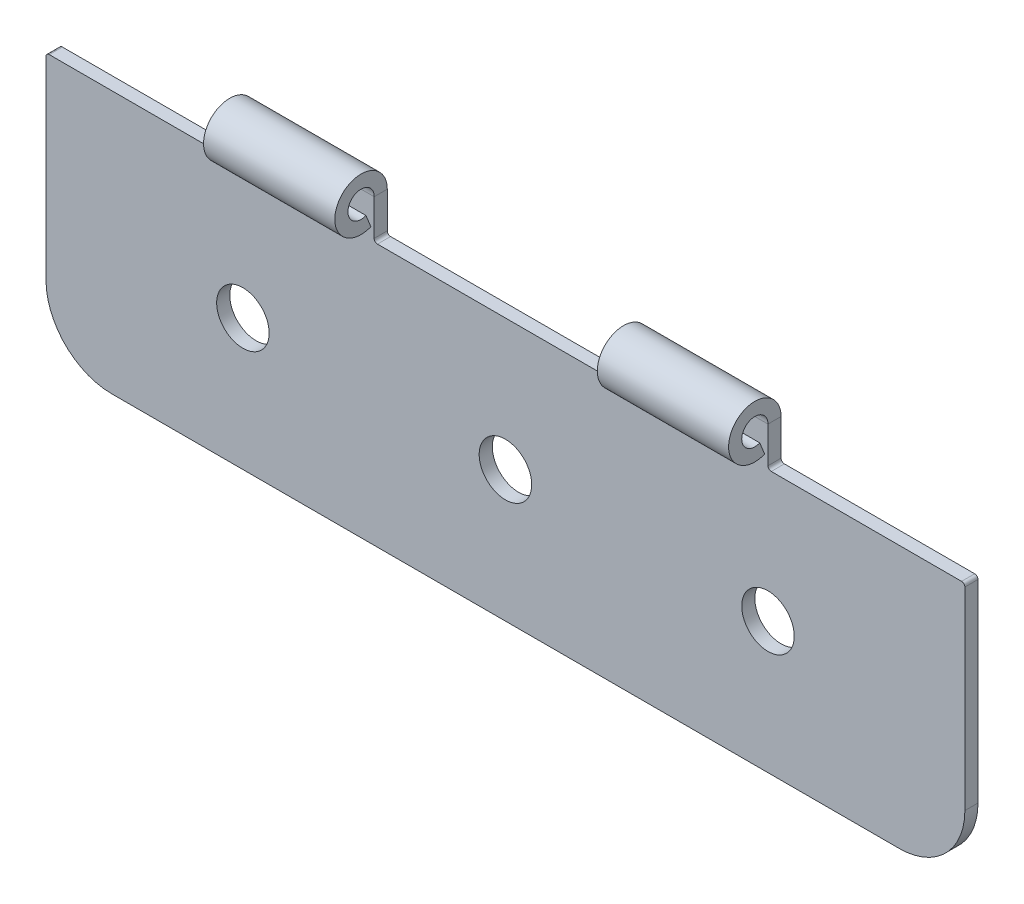
ISO-10303-21;
HEADER;
FILE_DESCRIPTION(('STEP AP214'),'2;1');
FILE_NAME('part.step','',(''),(''),'','','');
FILE_SCHEMA(('AUTOMOTIVE_DESIGN { 1 0 10303 214 1 1 1 1 }'));
ENDSEC;
DATA;
#1=APPLICATION_CONTEXT('core data for automotive mechanical design processes');
#2=APPLICATION_PROTOCOL_DEFINITION('international standard','automotive_design',2000,#1);
#3=PRODUCT_CONTEXT('',#1,'mechanical');
#4=PRODUCT('Part','Part','',(#3));
#5=PRODUCT_RELATED_PRODUCT_CATEGORY('part','',(#4));
#6=PRODUCT_DEFINITION_FORMATION('','',#4);
#7=PRODUCT_DEFINITION_CONTEXT('part definition',#1,'design');
#8=PRODUCT_DEFINITION('design','',#6,#7);
#9=PRODUCT_DEFINITION_SHAPE('','',#8);
#10=(LENGTH_UNIT() NAMED_UNIT(*) SI_UNIT(.MILLI.,.METRE.));
#11=(NAMED_UNIT(*) PLANE_ANGLE_UNIT() SI_UNIT($,.RADIAN.));
#12=(NAMED_UNIT(*) SI_UNIT($,.STERADIAN.) SOLID_ANGLE_UNIT());
#13=UNCERTAINTY_MEASURE_WITH_UNIT(LENGTH_MEASURE(1.E-05),#10,'distance_accuracy_value','');
#14=(GEOMETRIC_REPRESENTATION_CONTEXT(3) GLOBAL_UNCERTAINTY_ASSIGNED_CONTEXT((#13)) GLOBAL_UNIT_ASSIGNED_CONTEXT((#10,
#11,#12)) REPRESENTATION_CONTEXT('',''));
#15=CARTESIAN_POINT('',(0.,0.,0.));
#16=DIRECTION('',(0.,0.,1.));
#17=DIRECTION('',(1.,0.,0.));
#18=AXIS2_PLACEMENT_3D('',#15,#16,#17);
#19=CARTESIAN_POINT('',(85.,52.8350872140625,-3.69698140921907));
#20=DIRECTION('',(-1.,0.,0.));
#21=DIRECTION('',(0.,0.,1.));
#22=AXIS2_PLACEMENT_3D('',#19,#20,#21);
#23=PLANE('',#22);
#24=DIRECTION('',(0.,-1.,0.));
#25=VECTOR('',#24,1.);
#26=CARTESIAN_POINT('',(85.,52.8350872140625,-3.69698140921907));
#27=LINE('',#26,#25);
#28=CARTESIAN_POINT('',(85.,67.8350872140625,-3.69698140921908));
#29=VERTEX_POINT('',#28);
#30=CARTESIAN_POINT('',(85.,54.0850872140625,-3.69698140921907));
#31=VERTEX_POINT('',#30);
#32=EDGE_CURVE('E209',#29,#31,#27,.T.);
#33=ORIENTED_EDGE('',*,*,#32,.T.);
#34=DIRECTION('',(0.,0.,1.));
#35=VECTOR('',#34,1.);
#36=CARTESIAN_POINT('',(85.,54.0850872140625,1.30301859078093));
#37=LINE('',#36,#35);
#38=CARTESIAN_POINT('',(85.,54.0850872140625,1.30301859078093));
#39=VERTEX_POINT('',#38);
#40=EDGE_CURVE('E382',#31,#39,#37,.T.);
#41=ORIENTED_EDGE('',*,*,#40,.T.);
#42=DIRECTION('',(0.,-1.,0.));
#43=VECTOR('',#42,1.);
#44=CARTESIAN_POINT('',(85.,52.8350872140625,1.30301859078093));
#45=LINE('',#44,#43);
#46=CARTESIAN_POINT('',(85.,67.8350872140625,1.30301859078093));
#47=VERTEX_POINT('',#46);
#48=EDGE_CURVE('E325',#47,#39,#45,.T.);
#49=ORIENTED_EDGE('',*,*,#48,.F.);
#50=DIRECTION('',(0.,0.,-1.));
#51=VECTOR('',#50,1.);
#52=CARTESIAN_POINT('',(85.,67.8350872140625,1.30301859078092));
#53=LINE('',#52,#51);
#54=EDGE_CURVE('E221',#47,#29,#53,.T.);
#55=ORIENTED_EDGE('',*,*,#54,.T.);
#56=EDGE_LOOP('',(#33,#41,#49,#55));
#57=FACE_BOUND('',#56,.T.);
#58=ADVANCED_FACE('F42',(#57),#23,.T.);
#59=CARTESIAN_POINT('',(-65.,52.8350872140625,-3.69698140921907));
#60=DIRECTION('',(-1.,0.,0.));
#61=DIRECTION('',(0.,0.,1.));
#62=AXIS2_PLACEMENT_3D('',#59,#60,#61);
#63=PLANE('',#62);
#64=DIRECTION('',(0.,-1.,0.));
#65=VECTOR('',#64,1.);
#66=CARTESIAN_POINT('',(-65.,52.8350872140625,-3.69698140921907));
#67=LINE('',#66,#65);
#68=CARTESIAN_POINT('',(-65.,67.8350872140625,-3.69698140921908));
#69=VERTEX_POINT('',#68);
#70=CARTESIAN_POINT('',(-65.,54.0850872140625,-3.69698140921907));
#71=VERTEX_POINT('',#70);
#72=EDGE_CURVE('E306',#69,#71,#67,.T.);
#73=ORIENTED_EDGE('',*,*,#72,.T.);
#74=DIRECTION('',(0.,0.,1.));
#75=VECTOR('',#74,1.);
#76=CARTESIAN_POINT('',(-65.,54.0850872140625,1.30301859078093));
#77=LINE('',#76,#75);
#78=CARTESIAN_POINT('',(-65.,54.0850872140625,1.30301859078093));
#79=VERTEX_POINT('',#78);
#80=EDGE_CURVE('E385',#71,#79,#77,.T.);
#81=ORIENTED_EDGE('',*,*,#80,.T.);
#82=DIRECTION('',(0.,-1.,0.));
#83=VECTOR('',#82,1.);
#84=CARTESIAN_POINT('',(-65.,52.8350872140625,1.30301859078093));
#85=LINE('',#84,#83);
#86=CARTESIAN_POINT('',(-65.,67.8350872140625,1.30301859078093));
#87=VERTEX_POINT('',#86);
#88=EDGE_CURVE('E333',#87,#79,#85,.T.);
#89=ORIENTED_EDGE('',*,*,#88,.F.);
#90=DIRECTION('',(0.,0.,-1.));
#91=VECTOR('',#90,1.);
#92=CARTESIAN_POINT('',(-65.,67.8350872140625,1.30301859078092));
#93=LINE('',#92,#91);
#94=EDGE_CURVE('E265',#87,#69,#93,.T.);
#95=ORIENTED_EDGE('',*,*,#94,.T.);
#96=EDGE_LOOP('',(#73,#81,#89,#95));
#97=FACE_BOUND('',#96,.T.);
#98=ADVANCED_FACE('F421',(#97),#63,.T.);
#99=CARTESIAN_POINT('',(210.,-47.1649127859375,-3.69698140921907));
#100=DIRECTION('',(0.,-1.,0.));
#101=DIRECTION('',(1.,0.,0.));
#102=AXIS2_PLACEMENT_3D('',#99,#100,#101);
#103=PLANE('',#102);
#104=DIRECTION('',(1.,0.,0.));
#105=VECTOR('',#104,1.);
#106=CARTESIAN_POINT('',(210.,-47.1649127859375,-3.69698140921907));
#107=LINE('',#106,#105);
#108=CARTESIAN_POINT('',(-115.,-47.1649127859375,-3.69698140921907));
#109=VERTEX_POINT('',#108);
#110=CARTESIAN_POINT('',(185.,-47.1649127859375,-3.69698140921907));
#111=VERTEX_POINT('',#110);
#112=EDGE_CURVE('E291',#109,#111,#107,.T.);
#113=ORIENTED_EDGE('',*,*,#112,.T.);
#114=DIRECTION('',(0.,0.,1.));
#115=VECTOR('',#114,1.);
#116=CARTESIAN_POINT('',(185.,-47.1649127859375,-3.69698140921907));
#117=LINE('',#116,#115);
#118=CARTESIAN_POINT('',(185.,-47.1649127859375,1.30301859078093));
#119=VERTEX_POINT('',#118);
#120=EDGE_CURVE('E341',#111,#119,#117,.T.);
#121=ORIENTED_EDGE('',*,*,#120,.T.);
#122=DIRECTION('',(1.,0.,0.));
#123=VECTOR('',#122,1.);
#124=CARTESIAN_POINT('',(210.,-47.1649127859375,1.30301859078093));
#125=LINE('',#124,#123);
#126=CARTESIAN_POINT('',(-115.,-47.1649127859375,1.30301859078093));
#127=VERTEX_POINT('',#126);
#128=EDGE_CURVE('E288',#127,#119,#125,.T.);
#129=ORIENTED_EDGE('',*,*,#128,.F.);
#130=DIRECTION('',(0.,0.,1.));
#131=VECTOR('',#130,1.);
#132=CARTESIAN_POINT('',(-115.,-47.1649127859375,-3.69698140921907));
#133=LINE('',#132,#131);
#134=EDGE_CURVE('E314',#127,#109,#133,.F.);
#135=ORIENTED_EDGE('',*,*,#134,.T.);
#136=EDGE_LOOP('',(#113,#121,#129,#135));
#137=FACE_BOUND('',#136,.T.);
#138=ADVANCED_FACE('F478',(#137),#103,.T.);
#139=CARTESIAN_POINT('',(-140.,-47.1649127859375,-3.69698140921907));
#140=DIRECTION('',(-1.,0.,0.));
#141=DIRECTION('',(0.,0.,1.));
#142=AXIS2_PLACEMENT_3D('',#139,#140,#141);
#143=PLANE('',#142);
#144=DIRECTION('',(0.,-1.,0.));
#145=VECTOR('',#144,1.);
#146=CARTESIAN_POINT('',(-140.,-47.1649127859375,1.30301859078093));
#147=LINE('',#146,#145);
#148=CARTESIAN_POINT('',(-140.,51.5850872140625,1.30301859078093));
#149=VERTEX_POINT('',#148);
#150=CARTESIAN_POINT('',(-140.,-22.1649127859375,1.30301859078093));
#151=VERTEX_POINT('',#150);
#152=EDGE_CURVE('E295',#149,#151,#147,.T.);
#153=ORIENTED_EDGE('',*,*,#152,.F.);
#154=DIRECTION('',(0.,0.,1.));
#155=VECTOR('',#154,1.);
#156=CARTESIAN_POINT('',(-140.,51.5850872140625,-3.69698140921907));
#157=LINE('',#156,#155);
#158=CARTESIAN_POINT('',(-140.,51.5850872140625,-3.69698140921907));
#159=VERTEX_POINT('',#158);
#160=EDGE_CURVE('E393',#149,#159,#157,.F.);
#161=ORIENTED_EDGE('',*,*,#160,.T.);
#162=DIRECTION('',(0.,-1.,0.));
#163=VECTOR('',#162,1.);
#164=CARTESIAN_POINT('',(-140.,-47.1649127859375,-3.69698140921907));
#165=LINE('',#164,#163);
#166=CARTESIAN_POINT('',(-140.,-22.1649127859375,-3.69698140921907));
#167=VERTEX_POINT('',#166);
#168=EDGE_CURVE('E312',#159,#167,#165,.T.);
#169=ORIENTED_EDGE('',*,*,#168,.T.);
#170=DIRECTION('',(0.,0.,1.));
#171=VECTOR('',#170,1.);
#172=CARTESIAN_POINT('',(-140.,-22.1649127859375,-3.69698140921907));
#173=LINE('',#172,#171);
#174=EDGE_CURVE('E355',#167,#151,#173,.T.);
#175=ORIENTED_EDGE('',*,*,#174,.T.);
#176=EDGE_LOOP('',(#153,#161,#169,#175));
#177=FACE_BOUND('',#176,.T.);
#178=ADVANCED_FACE('F495',(#177),#143,.T.);
#179=CARTESIAN_POINT('',(-140.,52.8350872140625,-3.69698140921907));
#180=DIRECTION('',(0.,1.,0.));
#181=DIRECTION('',(0.,0.,1.));
#182=AXIS2_PLACEMENT_3D('',#179,#180,#181);
#183=PLANE('',#182);
#184=DIRECTION('',(-1.,0.,0.));
#185=VECTOR('',#184,1.);
#186=CARTESIAN_POINT('',(-140.,52.8350872140625,1.30301859078093));
#187=LINE('',#186,#185);
#188=CARTESIAN_POINT('',(-66.25,52.8350872140625,1.30301859078093));
#189=VERTEX_POINT('',#188);
#190=CARTESIAN_POINT('',(-138.75,52.8350872140625,1.30301859078093));
#191=VERTEX_POINT('',#190);
#192=EDGE_CURVE('E336',#189,#191,#187,.T.);
#193=ORIENTED_EDGE('',*,*,#192,.F.);
#194=DIRECTION('',(0.,0.,1.));
#195=VECTOR('',#194,1.);
#196=CARTESIAN_POINT('',(-66.25,52.8350872140625,-3.69698140921907));
#197=LINE('',#196,#195);
#198=CARTESIAN_POINT('',(-66.25,52.8350872140625,-3.69698140921907));
#199=VERTEX_POINT('',#198);
#200=EDGE_CURVE('E391',#189,#199,#197,.F.);
#201=ORIENTED_EDGE('',*,*,#200,.T.);
#202=DIRECTION('',(-1.,0.,0.));
#203=VECTOR('',#202,1.);
#204=CARTESIAN_POINT('',(-140.,52.8350872140625,-3.69698140921907));
#205=LINE('',#204,#203);
#206=CARTESIAN_POINT('',(-138.75,52.8350872140625,-3.69698140921907));
#207=VERTEX_POINT('',#206);
#208=EDGE_CURVE('E309',#199,#207,#205,.T.);
#209=ORIENTED_EDGE('',*,*,#208,.T.);
#210=DIRECTION('',(0.,0.,1.));
#211=VECTOR('',#210,1.);
#212=CARTESIAN_POINT('',(-138.75,52.8350872140625,-3.69698140921907));
#213=LINE('',#212,#211);
#214=EDGE_CURVE('E388',#207,#191,#213,.T.);
#215=ORIENTED_EDGE('',*,*,#214,.T.);
#216=EDGE_LOOP('',(#193,#201,#209,#215));
#217=FACE_BOUND('',#216,.T.);
#218=ADVANCED_FACE('F414',(#217),#183,.T.);
#219=CARTESIAN_POINT('',(-15.,77.8350872140625,-3.69698140921907));
#220=DIRECTION('',(1.,0.,0.));
#221=DIRECTION('',(0.,1.,0.));
#222=AXIS2_PLACEMENT_3D('',#219,#220,#221);
#223=PLANE('',#222);
#224=DIRECTION('',(0.,1.,0.));
#225=VECTOR('',#224,1.);
#226=CARTESIAN_POINT('',(-15.,77.8350872140625,1.30301859078093));
#227=LINE('',#226,#225);
#228=CARTESIAN_POINT('',(-15.,54.0850872140625,1.30301859078093));
#229=VERTEX_POINT('',#228);
#230=CARTESIAN_POINT('',(-15.,67.8350872140625,1.30301859078092));
#231=VERTEX_POINT('',#230);
#232=EDGE_CURVE('E331',#229,#231,#227,.T.);
#233=ORIENTED_EDGE('',*,*,#232,.F.);
#234=DIRECTION('',(0.,0.,1.));
#235=VECTOR('',#234,1.);
#236=CARTESIAN_POINT('',(-15.,54.0850872140625,-3.69698140921907));
#237=LINE('',#236,#235);
#238=CARTESIAN_POINT('',(-15.,54.0850872140625,-3.69698140921907));
#239=VERTEX_POINT('',#238);
#240=EDGE_CURVE('E380',#229,#239,#237,.F.);
#241=ORIENTED_EDGE('',*,*,#240,.T.);
#242=DIRECTION('',(0.,1.,0.));
#243=VECTOR('',#242,1.);
#244=CARTESIAN_POINT('',(-15.,77.8350872140625,-3.69698140921907));
#245=LINE('',#244,#243);
#246=CARTESIAN_POINT('',(-15.,67.8350872140625,-3.69698140921908));
#247=VERTEX_POINT('',#246);
#248=EDGE_CURVE('E304',#239,#247,#245,.T.);
#249=ORIENTED_EDGE('',*,*,#248,.T.);
#250=DIRECTION('',(0.,0.,-1.));
#251=VECTOR('',#250,1.);
#252=CARTESIAN_POINT('',(-15.,67.8350872140625,1.30301859078092));
#253=LINE('',#252,#251);
#254=EDGE_CURVE('E281',#231,#247,#253,.T.);
#255=ORIENTED_EDGE('',*,*,#254,.F.);
#256=EDGE_LOOP('',(#233,#241,#249,#255));
#257=FACE_BOUND('',#256,.T.);
#258=ADVANCED_FACE('F437',(#257),#223,.T.);
#259=CARTESIAN_POINT('',(-15.,52.8350872140625,-3.69698140921907));
#260=DIRECTION('',(0.,1.,0.));
#261=DIRECTION('',(0.,0.,1.));
#262=AXIS2_PLACEMENT_3D('',#259,#260,#261);
#263=PLANE('',#262);
#264=DIRECTION('',(-1.,0.,0.));
#265=VECTOR('',#264,1.);
#266=CARTESIAN_POINT('',(-15.,52.8350872140625,-3.69698140921907));
#267=LINE('',#266,#265);
#268=CARTESIAN_POINT('',(83.75,52.8350872140625,-3.69698140921907));
#269=VERTEX_POINT('',#268);
#270=CARTESIAN_POINT('',(-13.75,52.8350872140625,-3.69698140921907));
#271=VERTEX_POINT('',#270);
#272=EDGE_CURVE('E301',#269,#271,#267,.T.);
#273=ORIENTED_EDGE('',*,*,#272,.T.);
#274=DIRECTION('',(0.,0.,1.));
#275=VECTOR('',#274,1.);
#276=CARTESIAN_POINT('',(-13.75,52.8350872140625,1.30301859078093));
#277=LINE('',#276,#275);
#278=CARTESIAN_POINT('',(-13.75,52.8350872140625,1.30301859078093));
#279=VERTEX_POINT('',#278);
#280=EDGE_CURVE('E377',#271,#279,#277,.T.);
#281=ORIENTED_EDGE('',*,*,#280,.T.);
#282=DIRECTION('',(-1.,0.,0.));
#283=VECTOR('',#282,1.);
#284=CARTESIAN_POINT('',(-15.,52.8350872140625,1.30301859078093));
#285=LINE('',#284,#283);
#286=CARTESIAN_POINT('',(83.75,52.8350872140625,1.30301859078093));
#287=VERTEX_POINT('',#286);
#288=EDGE_CURVE('E328',#287,#279,#285,.T.);
#289=ORIENTED_EDGE('',*,*,#288,.F.);
#290=DIRECTION('',(0.,0.,1.));
#291=VECTOR('',#290,1.);
#292=CARTESIAN_POINT('',(83.75,52.8350872140625,-3.69698140921907));
#293=LINE('',#292,#291);
#294=EDGE_CURVE('E375',#287,#269,#293,.F.);
#295=ORIENTED_EDGE('',*,*,#294,.T.);
#296=EDGE_LOOP('',(#273,#281,#289,#295));
#297=FACE_BOUND('',#296,.T.);
#298=ADVANCED_FACE('F446',(#297),#263,.T.);
#299=CARTESIAN_POINT('',(135.,77.8350872140625,-3.69698140921907));
#300=DIRECTION('',(1.,0.,0.));
#301=DIRECTION('',(0.,0.,-1.));
#302=AXIS2_PLACEMENT_3D('',#299,#300,#301);
#303=PLANE('',#302);
#304=DIRECTION('',(0.,1.,0.));
#305=VECTOR('',#304,1.);
#306=CARTESIAN_POINT('',(135.,77.8350872140625,1.30301859078093));
#307=LINE('',#306,#305);
#308=CARTESIAN_POINT('',(135.,54.0850872140625,1.30301859078093));
#309=VERTEX_POINT('',#308);
#310=CARTESIAN_POINT('',(135.,67.8350872140625,1.30301859078092));
#311=VERTEX_POINT('',#310);
#312=EDGE_CURVE('E323',#309,#311,#307,.T.);
#313=ORIENTED_EDGE('',*,*,#312,.F.);
#314=DIRECTION('',(0.,0.,1.));
#315=VECTOR('',#314,1.);
#316=CARTESIAN_POINT('',(135.,54.0850872140625,-3.69698140921907));
#317=LINE('',#316,#315);
#318=CARTESIAN_POINT('',(135.,54.0850872140625,-3.69698140921907));
#319=VERTEX_POINT('',#318);
#320=EDGE_CURVE('E57',#309,#319,#317,.F.);
#321=ORIENTED_EDGE('',*,*,#320,.T.);
#322=DIRECTION('',(0.,1.,0.));
#323=VECTOR('',#322,1.);
#324=CARTESIAN_POINT('',(135.,77.8350872140625,-3.69698140921907));
#325=LINE('',#324,#323);
#326=CARTESIAN_POINT('',(135.,67.8350872140625,-3.69698140921908));
#327=VERTEX_POINT('',#326);
#328=EDGE_CURVE('E203',#319,#327,#325,.T.);
#329=ORIENTED_EDGE('',*,*,#328,.T.);
#330=DIRECTION('',(0.,0.,-1.));
#331=VECTOR('',#330,1.);
#332=CARTESIAN_POINT('',(135.,67.8350872140625,1.30301859078092));
#333=LINE('',#332,#331);
#334=EDGE_CURVE('E206',#311,#327,#333,.T.);
#335=ORIENTED_EDGE('',*,*,#334,.F.);
#336=EDGE_LOOP('',(#313,#321,#329,#335));
#337=FACE_BOUND('',#336,.T.);
#338=ADVANCED_FACE('F205',(#337),#303,.T.);
#339=CARTESIAN_POINT('',(135.,52.8350872140625,-3.69698140921907));
#340=DIRECTION('',(0.,1.,0.));
#341=DIRECTION('',(0.,0.,1.));
#342=AXIS2_PLACEMENT_3D('',#339,#340,#341);
#343=PLANE('',#342);
#344=DIRECTION('',(-1.,0.,0.));
#345=VECTOR('',#344,1.);
#346=CARTESIAN_POINT('',(135.,52.8350872140625,1.30301859078093));
#347=LINE('',#346,#345);
#348=CARTESIAN_POINT('',(208.75,52.8350872140625,1.30301859078093));
#349=VERTEX_POINT('',#348);
#350=CARTESIAN_POINT('',(136.25,52.8350872140625,1.30301859078093));
#351=VERTEX_POINT('',#350);
#352=EDGE_CURVE('E320',#349,#351,#347,.T.);
#353=ORIENTED_EDGE('',*,*,#352,.F.);
#354=DIRECTION('',(0.,0.,1.));
#355=VECTOR('',#354,1.);
#356=CARTESIAN_POINT('',(208.75,52.8350872140625,-3.69698140921907));
#357=LINE('',#356,#355);
#358=CARTESIAN_POINT('',(208.75,52.8350872140625,-3.69698140921907));
#359=VERTEX_POINT('',#358);
#360=EDGE_CURVE('E368',#349,#359,#357,.F.);
#361=ORIENTED_EDGE('',*,*,#360,.T.);
#362=DIRECTION('',(-1.,0.,0.));
#363=VECTOR('',#362,1.);
#364=CARTESIAN_POINT('',(135.,52.8350872140625,-3.69698140921907));
#365=LINE('',#364,#363);
#366=CARTESIAN_POINT('',(136.25,52.8350872140625,-3.69698140921907));
#367=VERTEX_POINT('',#366);
#368=EDGE_CURVE('E210',#359,#367,#365,.T.);
#369=ORIENTED_EDGE('',*,*,#368,.T.);
#370=DIRECTION('',(0.,0.,1.));
#371=VECTOR('',#370,1.);
#372=CARTESIAN_POINT('',(136.25,52.8350872140625,1.30301859078093));
#373=LINE('',#372,#371);
#374=EDGE_CURVE('E365',#367,#351,#373,.T.);
#375=ORIENTED_EDGE('',*,*,#374,.T.);
#376=EDGE_LOOP('',(#353,#361,#369,#375));
#377=FACE_BOUND('',#376,.T.);
#378=ADVANCED_FACE('F485',(#377),#343,.T.);
#379=CARTESIAN_POINT('',(210.,52.8350872140625,-3.69698140921907));
#380=DIRECTION('',(1.,0.,0.));
#381=DIRECTION('',(0.,0.,-1.));
#382=AXIS2_PLACEMENT_3D('',#379,#380,#381);
#383=PLANE('',#382);
#384=DIRECTION('',(0.,1.,0.));
#385=VECTOR('',#384,1.);
#386=CARTESIAN_POINT('',(210.,52.8350872140625,-3.69698140921907));
#387=LINE('',#386,#385);
#388=CARTESIAN_POINT('',(210.,-22.1649127859375,-3.69698140921907));
#389=VERTEX_POINT('',#388);
#390=CARTESIAN_POINT('',(210.,51.5850872140625,-3.69698140921907));
#391=VERTEX_POINT('',#390);
#392=EDGE_CURVE('E294',#389,#391,#387,.T.);
#393=ORIENTED_EDGE('',*,*,#392,.T.);
#394=DIRECTION('',(0.,0.,1.));
#395=VECTOR('',#394,1.);
#396=CARTESIAN_POINT('',(210.,51.5850872140625,-3.69698140921907));
#397=LINE('',#396,#395);
#398=CARTESIAN_POINT('',(210.,51.5850872140625,1.30301859078093));
#399=VERTEX_POINT('',#398);
#400=EDGE_CURVE('E358',#391,#399,#397,.T.);
#401=ORIENTED_EDGE('',*,*,#400,.T.);
#402=DIRECTION('',(0.,1.,0.));
#403=VECTOR('',#402,1.);
#404=CARTESIAN_POINT('',(210.,52.8350872140625,1.30301859078093));
#405=LINE('',#404,#403);
#406=CARTESIAN_POINT('',(210.,-22.1649127859375,1.30301859078093));
#407=VERTEX_POINT('',#406);
#408=EDGE_CURVE('E317',#407,#399,#405,.T.);
#409=ORIENTED_EDGE('',*,*,#408,.F.);
#410=DIRECTION('',(0.,0.,1.));
#411=VECTOR('',#410,1.);
#412=CARTESIAN_POINT('',(210.,-22.1649127859375,-3.69698140921907));
#413=LINE('',#412,#411);
#414=EDGE_CURVE('E348',#407,#389,#413,.F.);
#415=ORIENTED_EDGE('',*,*,#414,.T.);
#416=EDGE_LOOP('',(#393,#401,#409,#415));
#417=FACE_BOUND('',#416,.T.);
#418=ADVANCED_FACE('F488',(#417),#383,.T.);
#419=CARTESIAN_POINT('',(-140.,-47.1649127859375,-3.69698140921907));
#420=DIRECTION('',(0.,0.,-1.));
#421=DIRECTION('',(-1.,0.,0.));
#422=AXIS2_PLACEMENT_3D('',#419,#420,#421);
#423=PLANE('',#422);
#424=CARTESIAN_POINT('',(135.,2.83508721406253,-3.69698140921908));
#425=DIRECTION('',(0.,0.,1.));
#426=DIRECTION('',(1.,0.,0.));
#427=AXIS2_PLACEMENT_3D('',#424,#425,#426);
#428=CIRCLE('',#427,10.);
#429=CARTESIAN_POINT('',(145.,2.83508721406253,-3.69698140921908));
#430=VERTEX_POINT('',#429);
#431=EDGE_CURVE('E903',#430,#430,#428,.T.);
#432=ORIENTED_EDGE('',*,*,#431,.T.);
#433=EDGE_LOOP('',(#432));
#434=FACE_BOUND('',#433,.T.);
#435=CARTESIAN_POINT('',(35.,2.83508721406252,-3.69698140921908));
#436=DIRECTION('',(0.,0.,1.));
#437=DIRECTION('',(1.,0.,0.));
#438=AXIS2_PLACEMENT_3D('',#435,#436,#437);
#439=CIRCLE('',#438,10.);
#440=CARTESIAN_POINT('',(45.,2.83508721406252,-3.69698140921908));
#441=VERTEX_POINT('',#440);
#442=EDGE_CURVE('E911',#441,#441,#439,.T.);
#443=ORIENTED_EDGE('',*,*,#442,.T.);
#444=EDGE_LOOP('',(#443));
#445=FACE_BOUND('',#444,.T.);
#446=CARTESIAN_POINT('',(-65.,2.83508721406252,-3.69698140921908));
#447=DIRECTION('',(0.,0.,1.));
#448=DIRECTION('',(1.,0.,0.));
#449=AXIS2_PLACEMENT_3D('',#446,#447,#448);
#450=CIRCLE('',#449,10.);
#451=CARTESIAN_POINT('',(-55.,2.83508721406252,-3.69698140921908));
#452=VERTEX_POINT('',#451);
#453=EDGE_CURVE('E250',#452,#452,#450,.T.);
#454=ORIENTED_EDGE('',*,*,#453,.T.);
#455=EDGE_LOOP('',(#454));
#456=FACE_BOUND('',#455,.T.);
#457=ORIENTED_EDGE('',*,*,#368,.F.);
#458=CARTESIAN_POINT('',(208.75,51.5850872140625,-3.69698140921907));
#459=DIRECTION('',(0.,0.,-1.));
#460=DIRECTION('',(-1.,0.,0.));
#461=AXIS2_PLACEMENT_3D('',#458,#459,#460);
#462=CIRCLE('',#461,1.25);
#463=EDGE_CURVE('E372',#359,#391,#462,.T.);
#464=ORIENTED_EDGE('',*,*,#463,.T.);
#465=ORIENTED_EDGE('',*,*,#392,.F.);
#466=CARTESIAN_POINT('',(185.,-22.1649127859375,-3.69698140921907));
#467=DIRECTION('',(0.,0.,-1.));
#468=DIRECTION('',(-1.,0.,0.));
#469=AXIS2_PLACEMENT_3D('',#466,#467,#468);
#470=CIRCLE('',#469,25.);
#471=EDGE_CURVE('E353',#389,#111,#470,.T.);
#472=ORIENTED_EDGE('',*,*,#471,.T.);
#473=ORIENTED_EDGE('',*,*,#112,.F.);
#474=CARTESIAN_POINT('',(-115.,-22.1649127859375,-3.69698140921907));
#475=DIRECTION('',(0.,0.,-1.));
#476=DIRECTION('',(-1.,0.,0.));
#477=AXIS2_PLACEMENT_3D('',#474,#475,#476);
#478=CIRCLE('',#477,25.);
#479=EDGE_CURVE('E350',#109,#167,#478,.T.);
#480=ORIENTED_EDGE('',*,*,#479,.T.);
#481=ORIENTED_EDGE('',*,*,#168,.F.);
#482=CARTESIAN_POINT('',(-138.75,51.5850872140625,-3.69698140921907));
#483=DIRECTION('',(0.,0.,-1.));
#484=DIRECTION('',(-1.,0.,0.));
#485=AXIS2_PLACEMENT_3D('',#482,#483,#484);
#486=CIRCLE('',#485,1.25);
#487=EDGE_CURVE('E370',#159,#207,#486,.T.);
#488=ORIENTED_EDGE('',*,*,#487,.T.);
#489=ORIENTED_EDGE('',*,*,#208,.F.);
#490=CARTESIAN_POINT('',(-66.25,54.0850872140625,-3.69698140921907));
#491=DIRECTION('',(0.,0.,-1.));
#492=DIRECTION('',(-1.,0.,0.));
#493=AXIS2_PLACEMENT_3D('',#490,#491,#492);
#494=CIRCLE('',#493,1.25);
#495=EDGE_CURVE('E11',#199,#71,#494,.F.);
#496=ORIENTED_EDGE('',*,*,#495,.T.);
#497=ORIENTED_EDGE('',*,*,#72,.F.);
#498=DIRECTION('',(-1.,0.,0.));
#499=VECTOR('',#498,1.);
#500=CARTESIAN_POINT('',(-65.,67.8350872140625,-3.69698140921908));
#501=LINE('',#500,#499);
#502=EDGE_CURVE('E258',#69,#247,#501,.F.);
#503=ORIENTED_EDGE('',*,*,#502,.T.);
#504=ORIENTED_EDGE('',*,*,#248,.F.);
#505=CARTESIAN_POINT('',(-13.75,54.0850872140625,-3.69698140921907));
#506=DIRECTION('',(0.,0.,-1.));
#507=DIRECTION('',(-1.,0.,0.));
#508=AXIS2_PLACEMENT_3D('',#505,#506,#507);
#509=CIRCLE('',#508,1.25);
#510=EDGE_CURVE('E401',#239,#271,#509,.F.);
#511=ORIENTED_EDGE('',*,*,#510,.T.);
#512=ORIENTED_EDGE('',*,*,#272,.F.);
#513=CARTESIAN_POINT('',(83.75,54.0850872140625,-3.69698140921907));
#514=DIRECTION('',(0.,0.,-1.));
#515=DIRECTION('',(-1.,0.,0.));
#516=AXIS2_PLACEMENT_3D('',#513,#514,#515);
#517=CIRCLE('',#516,1.25);
#518=EDGE_CURVE('E65',#269,#31,#517,.F.);
#519=ORIENTED_EDGE('',*,*,#518,.T.);
#520=ORIENTED_EDGE('',*,*,#32,.F.);
#521=DIRECTION('',(-1.,0.,0.));
#522=VECTOR('',#521,1.);
#523=CARTESIAN_POINT('',(85.,67.8350872140625,-3.69698140921908));
#524=LINE('',#523,#522);
#525=EDGE_CURVE('E227',#29,#327,#524,.F.);
#526=ORIENTED_EDGE('',*,*,#525,.T.);
#527=ORIENTED_EDGE('',*,*,#328,.F.);
#528=CARTESIAN_POINT('',(136.25,54.0850872140625,-3.69698140921907));
#529=DIRECTION('',(0.,0.,-1.));
#530=DIRECTION('',(-1.,0.,0.));
#531=AXIS2_PLACEMENT_3D('',#528,#529,#530);
#532=CIRCLE('',#531,1.25);
#533=EDGE_CURVE('E397',#319,#367,#532,.F.);
#534=ORIENTED_EDGE('',*,*,#533,.T.);
#535=EDGE_LOOP('',(#457,#464,#465,#472,#473,#480,#481,#488,#489,#496,#497,#503,#504,#511,#512,
#519,#520,#526,#527,#534));
#536=FACE_BOUND('',#535,.T.);
#537=ADVANCED_FACE('F233',(#434,#445,#456,#536),#423,.T.);
#538=CARTESIAN_POINT('',(-140.,-47.1649127859375,1.30301859078093));
#539=DIRECTION('',(0.,0.,-1.));
#540=DIRECTION('',(-1.,0.,0.));
#541=AXIS2_PLACEMENT_3D('',#538,#539,#540);
#542=PLANE('',#541);
#543=CARTESIAN_POINT('',(135.,2.83508721406253,1.30301859078093));
#544=DIRECTION('',(0.,0.,1.));
#545=DIRECTION('',(1.,0.,0.));
#546=AXIS2_PLACEMENT_3D('',#543,#544,#545);
#547=CIRCLE('',#546,10.);
#548=CARTESIAN_POINT('',(145.,2.83508721406253,1.30301859078093));
#549=VERTEX_POINT('',#548);
#550=EDGE_CURVE('E906',#549,#549,#547,.T.);
#551=ORIENTED_EDGE('',*,*,#550,.F.);
#552=EDGE_LOOP('',(#551));
#553=FACE_BOUND('',#552,.T.);
#554=CARTESIAN_POINT('',(35.,2.83508721406252,1.30301859078093));
#555=DIRECTION('',(0.,0.,1.));
#556=DIRECTION('',(1.,0.,0.));
#557=AXIS2_PLACEMENT_3D('',#554,#555,#556);
#558=CIRCLE('',#557,10.);
#559=CARTESIAN_POINT('',(45.,2.83508721406252,1.30301859078093));
#560=VERTEX_POINT('',#559);
#561=EDGE_CURVE('E908',#560,#560,#558,.T.);
#562=ORIENTED_EDGE('',*,*,#561,.F.);
#563=EDGE_LOOP('',(#562));
#564=FACE_BOUND('',#563,.T.);
#565=CARTESIAN_POINT('',(-65.,2.83508721406252,1.30301859078093));
#566=DIRECTION('',(0.,0.,1.));
#567=DIRECTION('',(1.,0.,0.));
#568=AXIS2_PLACEMENT_3D('',#565,#566,#567);
#569=CIRCLE('',#568,10.);
#570=CARTESIAN_POINT('',(-55.,2.83508721406252,1.30301859078093));
#571=VERTEX_POINT('',#570);
#572=EDGE_CURVE('E238',#571,#571,#569,.T.);
#573=ORIENTED_EDGE('',*,*,#572,.F.);
#574=EDGE_LOOP('',(#573));
#575=FACE_BOUND('',#574,.T.);
#576=ORIENTED_EDGE('',*,*,#408,.T.);
#577=CARTESIAN_POINT('',(208.75,51.5850872140625,1.30301859078093));
#578=DIRECTION('',(0.,0.,-1.));
#579=DIRECTION('',(-1.,0.,0.));
#580=AXIS2_PLACEMENT_3D('',#577,#578,#579);
#581=CIRCLE('',#580,1.25);
#582=EDGE_CURVE('E363',#399,#349,#581,.F.);
#583=ORIENTED_EDGE('',*,*,#582,.T.);
#584=ORIENTED_EDGE('',*,*,#352,.T.);
#585=CARTESIAN_POINT('',(136.25,54.0850872140625,1.30301859078093));
#586=DIRECTION('',(0.,0.,-1.));
#587=DIRECTION('',(-1.,0.,0.));
#588=AXIS2_PLACEMENT_3D('',#585,#586,#587);
#589=CIRCLE('',#588,1.25);
#590=EDGE_CURVE('E395',#351,#309,#589,.T.);
#591=ORIENTED_EDGE('',*,*,#590,.T.);
#592=ORIENTED_EDGE('',*,*,#312,.T.);
#593=DIRECTION('',(-1.,0.,0.));
#594=VECTOR('',#593,1.);
#595=CARTESIAN_POINT('',(85.,67.8350872140625,1.30301859078092));
#596=LINE('',#595,#594);
#597=EDGE_CURVE('E243',#47,#311,#596,.F.);
#598=ORIENTED_EDGE('',*,*,#597,.F.);
#599=ORIENTED_EDGE('',*,*,#48,.T.);
#600=CARTESIAN_POINT('',(83.75,54.0850872140625,1.30301859078093));
#601=DIRECTION('',(0.,0.,-1.));
#602=DIRECTION('',(-1.,0.,0.));
#603=AXIS2_PLACEMENT_3D('',#600,#601,#602);
#604=CIRCLE('',#603,1.25);
#605=EDGE_CURVE('E403',#39,#287,#604,.T.);
#606=ORIENTED_EDGE('',*,*,#605,.T.);
#607=ORIENTED_EDGE('',*,*,#288,.T.);
#608=CARTESIAN_POINT('',(-13.75,54.0850872140625,1.30301859078093));
#609=DIRECTION('',(0.,0.,-1.));
#610=DIRECTION('',(-1.,0.,0.));
#611=AXIS2_PLACEMENT_3D('',#608,#609,#610);
#612=CIRCLE('',#611,1.25);
#613=EDGE_CURVE('E399',#279,#229,#612,.T.);
#614=ORIENTED_EDGE('',*,*,#613,.T.);
#615=ORIENTED_EDGE('',*,*,#232,.T.);
#616=DIRECTION('',(-1.,0.,0.));
#617=VECTOR('',#616,1.);
#618=CARTESIAN_POINT('',(-65.,67.8350872140625,1.30301859078092));
#619=LINE('',#618,#617);
#620=EDGE_CURVE('E274',#87,#231,#619,.F.);
#621=ORIENTED_EDGE('',*,*,#620,.F.);
#622=ORIENTED_EDGE('',*,*,#88,.T.);
#623=CARTESIAN_POINT('',(-66.25,54.0850872140625,1.30301859078093));
#624=DIRECTION('',(0.,0.,-1.));
#625=DIRECTION('',(-1.,0.,0.));
#626=AXIS2_PLACEMENT_3D('',#623,#624,#625);
#627=CIRCLE('',#626,1.25);
#628=EDGE_CURVE('E50',#79,#189,#627,.T.);
#629=ORIENTED_EDGE('',*,*,#628,.T.);
#630=ORIENTED_EDGE('',*,*,#192,.T.);
#631=CARTESIAN_POINT('',(-138.75,51.5850872140625,1.30301859078093));
#632=DIRECTION('',(0.,0.,-1.));
#633=DIRECTION('',(-1.,0.,0.));
#634=AXIS2_PLACEMENT_3D('',#631,#632,#633);
#635=CIRCLE('',#634,1.25);
#636=EDGE_CURVE('E361',#191,#149,#635,.F.);
#637=ORIENTED_EDGE('',*,*,#636,.T.);
#638=ORIENTED_EDGE('',*,*,#152,.T.);
#639=CARTESIAN_POINT('',(-115.,-22.1649127859375,1.30301859078093));
#640=DIRECTION('',(0.,0.,-1.));
#641=DIRECTION('',(-1.,0.,0.));
#642=AXIS2_PLACEMENT_3D('',#639,#640,#641);
#643=CIRCLE('',#642,25.);
#644=EDGE_CURVE('E344',#151,#127,#643,.F.);
#645=ORIENTED_EDGE('',*,*,#644,.T.);
#646=ORIENTED_EDGE('',*,*,#128,.T.);
#647=CARTESIAN_POINT('',(185.,-22.1649127859375,1.30301859078093));
#648=DIRECTION('',(0.,0.,-1.));
#649=DIRECTION('',(-1.,0.,0.));
#650=AXIS2_PLACEMENT_3D('',#647,#648,#649);
#651=CIRCLE('',#650,25.);
#652=EDGE_CURVE('E346',#119,#407,#651,.F.);
#653=ORIENTED_EDGE('',*,*,#652,.T.);
#654=EDGE_LOOP('',(#576,#583,#584,#591,#592,#598,#599,#606,#607,#614,#615,#621,#622,#629,#630,
#637,#638,#645,#646,#653));
#655=FACE_BOUND('',#654,.T.);
#656=ADVANCED_FACE('F407',(#553,#564,#575,#655),#542,.F.);
#657=CARTESIAN_POINT('',(-40.,63.1991679412286,4.42998562370133));
#658=DIRECTION('',(0.,-0.374606593415919,0.927183854566785));
#659=DIRECTION('',(-1.,0.,0.));
#660=AXIS2_PLACEMENT_3D('',#657,#658,#659);
#661=PLANE('',#660);
#662=DIRECTION('',(0.,-0.927183854566785,-0.374606593415919));
#663=VECTOR('',#662,1.);
#664=CARTESIAN_POINT('',(-65.,63.1991679412286,4.42998562370133));
#665=LINE('',#664,#663);
#666=CARTESIAN_POINT('',(-65.,63.1991679412286,4.42998562370133));
#667=VERTEX_POINT('',#666);
#668=CARTESIAN_POINT('',(-65.,58.5632486683947,2.55695265662173));
#669=VERTEX_POINT('',#668);
#670=EDGE_CURVE('E286',#667,#669,#665,.T.);
#671=ORIENTED_EDGE('',*,*,#670,.F.);
#672=DIRECTION('',(-1.,0.,0.));
#673=VECTOR('',#672,1.);
#674=CARTESIAN_POINT('',(-65.,63.1991679412286,4.42998562370133));
#675=LINE('',#674,#673);
#676=CARTESIAN_POINT('',(-15.,63.1991679412286,4.42998562370133));
#677=VERTEX_POINT('',#676);
#678=EDGE_CURVE('E255',#677,#667,#675,.T.);
#679=ORIENTED_EDGE('',*,*,#678,.F.);
#680=DIRECTION('',(0.,-0.927183854566785,-0.374606593415919));
#681=VECTOR('',#680,1.);
#682=CARTESIAN_POINT('',(-15.,63.1991679412286,4.42998562370133));
#683=LINE('',#682,#681);
#684=CARTESIAN_POINT('',(-15.,58.5632486683947,2.55695265662173));
#685=VERTEX_POINT('',#684);
#686=EDGE_CURVE('E284',#677,#685,#683,.T.);
#687=ORIENTED_EDGE('',*,*,#686,.T.);
#688=DIRECTION('',(-1.,0.,0.));
#689=VECTOR('',#688,1.);
#690=CARTESIAN_POINT('',(-65.,58.5632486683947,2.55695265662173));
#691=LINE('',#690,#689);
#692=EDGE_CURVE('E266',#685,#669,#691,.T.);
#693=ORIENTED_EDGE('',*,*,#692,.T.);
#694=EDGE_LOOP('',(#671,#679,#687,#693));
#695=FACE_BOUND('',#694,.T.);
#696=ADVANCED_FACE('F583',(#695),#661,.F.);
#697=CARTESIAN_POINT('',(-15.,67.8350872140625,6.30301859078093));
#698=DIRECTION('',(1.,0.,0.));
#699=DIRECTION('',(0.,0.,-1.));
#700=AXIS2_PLACEMENT_3D('',#697,#698,#699);
#701=PLANE('',#700);
#702=ORIENTED_EDGE('',*,*,#686,.F.);
#703=CARTESIAN_POINT('',(-15.,67.8350872140625,6.30301859078093));
#704=DIRECTION('',(-1.,0.,0.));
#705=DIRECTION('',(0.,0.,1.));
#706=AXIS2_PLACEMENT_3D('',#703,#704,#705);
#707=CIRCLE('',#706,5.00000000000001);
#708=EDGE_CURVE('E269',#231,#677,#707,.F.);
#709=ORIENTED_EDGE('',*,*,#708,.F.);
#710=ORIENTED_EDGE('',*,*,#254,.T.);
#711=CARTESIAN_POINT('',(-15.,67.8350872140625,6.30301859078093));
#712=DIRECTION('',(-1.,0.,0.));
#713=DIRECTION('',(0.,0.,1.));
#714=AXIS2_PLACEMENT_3D('',#711,#712,#713);
#715=CIRCLE('',#714,10.);
#716=EDGE_CURVE('E261',#247,#685,#715,.F.);
#717=ORIENTED_EDGE('',*,*,#716,.T.);
#718=EDGE_LOOP('',(#702,#709,#710,#717));
#719=FACE_BOUND('',#718,.T.);
#720=ADVANCED_FACE('F433',(#719),#701,.T.);
#721=CARTESIAN_POINT('',(-65.,67.8350872140625,6.30301859078093));
#722=DIRECTION('',(1.,0.,0.));
#723=DIRECTION('',(0.,0.,-1.));
#724=AXIS2_PLACEMENT_3D('',#721,#722,#723);
#725=PLANE('',#724);
#726=CARTESIAN_POINT('',(-65.,67.8350872140625,6.30301859078093));
#727=DIRECTION('',(-1.,0.,0.));
#728=DIRECTION('',(0.,0.,1.));
#729=AXIS2_PLACEMENT_3D('',#726,#727,#728);
#730=CIRCLE('',#729,5.00000000000001);
#731=EDGE_CURVE('E277',#667,#87,#730,.T.);
#732=ORIENTED_EDGE('',*,*,#731,.F.);
#733=ORIENTED_EDGE('',*,*,#670,.T.);
#734=CARTESIAN_POINT('',(-65.,67.8350872140625,6.30301859078093));
#735=DIRECTION('',(-1.,0.,0.));
#736=DIRECTION('',(0.,0.,1.));
#737=AXIS2_PLACEMENT_3D('',#734,#735,#736);
#738=CIRCLE('',#737,10.);
#739=EDGE_CURVE('E262',#669,#69,#738,.T.);
#740=ORIENTED_EDGE('',*,*,#739,.T.);
#741=ORIENTED_EDGE('',*,*,#94,.F.);
#742=EDGE_LOOP('',(#732,#733,#740,#741));
#743=FACE_BOUND('',#742,.T.);
#744=ADVANCED_FACE('F425',(#743),#725,.F.);
#745=CARTESIAN_POINT('',(-65.,67.8350872140625,6.30301859078093));
#746=DIRECTION('',(-1.,0.,0.));
#747=DIRECTION('',(0.,-0.927183854566784,-0.374606593415919));
#748=AXIS2_PLACEMENT_3D('',#745,#746,#747);
#749=CYLINDRICAL_SURFACE('',#748,10.);
#750=ORIENTED_EDGE('',*,*,#502,.F.);
#751=ORIENTED_EDGE('',*,*,#739,.F.);
#752=ORIENTED_EDGE('',*,*,#692,.F.);
#753=ORIENTED_EDGE('',*,*,#716,.F.);
#754=EDGE_LOOP('',(#750,#751,#752,#753));
#755=FACE_BOUND('',#754,.T.);
#756=ADVANCED_FACE('F470',(#755),#749,.T.);
#757=CARTESIAN_POINT('',(-65.,67.8350872140625,6.30301859078093));
#758=DIRECTION('',(-1.,0.,0.));
#759=DIRECTION('',(0.,-0.927183854566784,-0.374606593415919));
#760=AXIS2_PLACEMENT_3D('',#757,#758,#759);
#761=CYLINDRICAL_SURFACE('',#760,5.00000000000001);
#762=ORIENTED_EDGE('',*,*,#620,.T.);
#763=ORIENTED_EDGE('',*,*,#708,.T.);
#764=ORIENTED_EDGE('',*,*,#678,.T.);
#765=ORIENTED_EDGE('',*,*,#731,.T.);
#766=EDGE_LOOP('',(#762,#763,#764,#765));
#767=FACE_BOUND('',#766,.T.);
#768=ADVANCED_FACE('F430',(#767),#761,.F.);
#769=CARTESIAN_POINT('',(110.,63.1991679412286,4.42998562370133));
#770=DIRECTION('',(0.,-0.374606593415919,0.927183854566785));
#771=DIRECTION('',(-1.,0.,0.));
#772=AXIS2_PLACEMENT_3D('',#769,#770,#771);
#773=PLANE('',#772);
#774=DIRECTION('',(0.,-0.927183854566785,-0.374606593415919));
#775=VECTOR('',#774,1.);
#776=CARTESIAN_POINT('',(85.,63.1991679412286,4.42998562370133));
#777=LINE('',#776,#775);
#778=CARTESIAN_POINT('',(85.,63.1991679412286,4.42998562370133));
#779=VERTEX_POINT('',#778);
#780=CARTESIAN_POINT('',(85.,58.5632486683947,2.55695265662173));
#781=VERTEX_POINT('',#780);
#782=EDGE_CURVE('E253',#779,#781,#777,.T.);
#783=ORIENTED_EDGE('',*,*,#782,.F.);
#784=DIRECTION('',(-1.,0.,0.));
#785=VECTOR('',#784,1.);
#786=CARTESIAN_POINT('',(85.,63.1991679412286,4.42998562370133));
#787=LINE('',#786,#785);
#788=CARTESIAN_POINT('',(135.,63.1991679412286,4.42998562370133));
#789=VERTEX_POINT('',#788);
#790=EDGE_CURVE('E248',#789,#779,#787,.T.);
#791=ORIENTED_EDGE('',*,*,#790,.F.);
#792=DIRECTION('',(0.,-0.927183854566785,-0.374606593415919));
#793=VECTOR('',#792,1.);
#794=CARTESIAN_POINT('',(135.,63.1991679412286,4.42998562370133));
#795=LINE('',#794,#793);
#796=CARTESIAN_POINT('',(135.,58.5632486683947,2.55695265662173));
#797=VERTEX_POINT('',#796);
#798=EDGE_CURVE('E220',#789,#797,#795,.T.);
#799=ORIENTED_EDGE('',*,*,#798,.T.);
#800=DIRECTION('',(-1.,0.,0.));
#801=VECTOR('',#800,1.);
#802=CARTESIAN_POINT('',(85.,58.5632486683947,2.55695265662173));
#803=LINE('',#802,#801);
#804=EDGE_CURVE('E230',#797,#781,#803,.T.);
#805=ORIENTED_EDGE('',*,*,#804,.T.);
#806=EDGE_LOOP('',(#783,#791,#799,#805));
#807=FACE_BOUND('',#806,.T.);
#808=ADVANCED_FACE('F462',(#807),#773,.F.);
#809=CARTESIAN_POINT('',(135.,67.8350872140625,6.30301859078093));
#810=DIRECTION('',(1.,0.,0.));
#811=DIRECTION('',(0.,0.,-1.));
#812=AXIS2_PLACEMENT_3D('',#809,#810,#811);
#813=PLANE('',#812);
#814=ORIENTED_EDGE('',*,*,#798,.F.);
#815=CARTESIAN_POINT('',(135.,67.8350872140625,6.30301859078093));
#816=DIRECTION('',(-1.,0.,0.));
#817=DIRECTION('',(0.,0.,1.));
#818=AXIS2_PLACEMENT_3D('',#815,#816,#817);
#819=CIRCLE('',#818,5.00000000000001);
#820=EDGE_CURVE('E219',#311,#789,#819,.F.);
#821=ORIENTED_EDGE('',*,*,#820,.F.);
#822=ORIENTED_EDGE('',*,*,#334,.T.);
#823=CARTESIAN_POINT('',(135.,67.8350872140625,6.30301859078093));
#824=DIRECTION('',(-1.,0.,0.));
#825=DIRECTION('',(0.,0.,1.));
#826=AXIS2_PLACEMENT_3D('',#823,#824,#825);
#827=CIRCLE('',#826,10.);
#828=EDGE_CURVE('E217',#327,#797,#827,.F.);
#829=ORIENTED_EDGE('',*,*,#828,.T.);
#830=EDGE_LOOP('',(#814,#821,#822,#829));
#831=FACE_BOUND('',#830,.T.);
#832=ADVANCED_FACE('F216',(#831),#813,.T.);
#833=CARTESIAN_POINT('',(85.,67.8350872140625,6.30301859078093));
#834=DIRECTION('',(1.,0.,0.));
#835=DIRECTION('',(0.,0.,-1.));
#836=AXIS2_PLACEMENT_3D('',#833,#834,#835);
#837=PLANE('',#836);
#838=CARTESIAN_POINT('',(85.,67.8350872140625,6.30301859078093));
#839=DIRECTION('',(-1.,0.,0.));
#840=DIRECTION('',(0.,0.,1.));
#841=AXIS2_PLACEMENT_3D('',#838,#839,#840);
#842=CIRCLE('',#841,5.00000000000001);
#843=EDGE_CURVE('E246',#779,#47,#842,.T.);
#844=ORIENTED_EDGE('',*,*,#843,.F.);
#845=ORIENTED_EDGE('',*,*,#782,.T.);
#846=CARTESIAN_POINT('',(85.,67.8350872140625,6.30301859078093));
#847=DIRECTION('',(-1.,0.,0.));
#848=DIRECTION('',(0.,0.,1.));
#849=AXIS2_PLACEMENT_3D('',#846,#847,#848);
#850=CIRCLE('',#849,10.);
#851=EDGE_CURVE('E234',#781,#29,#850,.T.);
#852=ORIENTED_EDGE('',*,*,#851,.T.);
#853=ORIENTED_EDGE('',*,*,#54,.F.);
#854=EDGE_LOOP('',(#844,#845,#852,#853));
#855=FACE_BOUND('',#854,.T.);
#856=ADVANCED_FACE('F457',(#855),#837,.F.);
#857=CARTESIAN_POINT('',(85.,67.8350872140625,6.30301859078093));
#858=DIRECTION('',(-1.,0.,0.));
#859=DIRECTION('',(0.,-0.927183854566784,-0.374606593415919));
#860=AXIS2_PLACEMENT_3D('',#857,#858,#859);
#861=CYLINDRICAL_SURFACE('',#860,10.);
#862=ORIENTED_EDGE('',*,*,#525,.F.);
#863=ORIENTED_EDGE('',*,*,#851,.F.);
#864=ORIENTED_EDGE('',*,*,#804,.F.);
#865=ORIENTED_EDGE('',*,*,#828,.F.);
#866=EDGE_LOOP('',(#862,#863,#864,#865));
#867=FACE_BOUND('',#866,.T.);
#868=ADVANCED_FACE('F225',(#867),#861,.T.);
#869=CARTESIAN_POINT('',(85.,67.8350872140625,6.30301859078093));
#870=DIRECTION('',(-1.,0.,0.));
#871=DIRECTION('',(0.,-0.927183854566784,-0.374606593415919));
#872=AXIS2_PLACEMENT_3D('',#869,#870,#871);
#873=CYLINDRICAL_SURFACE('',#872,5.00000000000001);
#874=ORIENTED_EDGE('',*,*,#597,.T.);
#875=ORIENTED_EDGE('',*,*,#820,.T.);
#876=ORIENTED_EDGE('',*,*,#790,.T.);
#877=ORIENTED_EDGE('',*,*,#843,.T.);
#878=EDGE_LOOP('',(#874,#875,#876,#877));
#879=FACE_BOUND('',#878,.T.);
#880=ADVANCED_FACE('F459',(#879),#873,.F.);
#881=CARTESIAN_POINT('',(-65.,2.83508721406252,-3.69698140921908));
#882=DIRECTION('',(0.,0.,1.));
#883=DIRECTION('',(1.,0.,0.));
#884=AXIS2_PLACEMENT_3D('',#881,#882,#883);
#885=CYLINDRICAL_SURFACE('',#884,10.);
#886=ORIENTED_EDGE('',*,*,#453,.F.);
#887=EDGE_LOOP('',(#886));
#888=FACE_BOUND('',#887,.T.);
#889=ORIENTED_EDGE('',*,*,#572,.T.);
#890=EDGE_LOOP('',(#889));
#891=FACE_BOUND('',#890,.T.);
#892=ADVANCED_FACE('F653',(#888,#891),#885,.F.);
#893=CARTESIAN_POINT('',(35.,2.83508721406252,-3.69698140921908));
#894=DIRECTION('',(0.,0.,1.));
#895=DIRECTION('',(1.,0.,0.));
#896=AXIS2_PLACEMENT_3D('',#893,#894,#895);
#897=CYLINDRICAL_SURFACE('',#896,10.);
#898=ORIENTED_EDGE('',*,*,#442,.F.);
#899=EDGE_LOOP('',(#898));
#900=FACE_BOUND('',#899,.T.);
#901=ORIENTED_EDGE('',*,*,#561,.T.);
#902=EDGE_LOOP('',(#901));
#903=FACE_BOUND('',#902,.T.);
#904=ADVANCED_FACE('F663',(#900,#903),#897,.F.);
#905=CARTESIAN_POINT('',(135.,2.83508721406253,-3.69698140921908));
#906=DIRECTION('',(0.,0.,1.));
#907=DIRECTION('',(1.,0.,0.));
#908=AXIS2_PLACEMENT_3D('',#905,#906,#907);
#909=CYLINDRICAL_SURFACE('',#908,10.);
#910=ORIENTED_EDGE('',*,*,#431,.F.);
#911=EDGE_LOOP('',(#910));
#912=FACE_BOUND('',#911,.T.);
#913=ORIENTED_EDGE('',*,*,#550,.T.);
#914=EDGE_LOOP('',(#913));
#915=FACE_BOUND('',#914,.T.);
#916=ADVANCED_FACE('F501',(#912,#915),#909,.F.);
#917=CARTESIAN_POINT('',(185.,-22.1649127859375,-3.69698140921907));
#918=DIRECTION('',(0.,0.,1.));
#919=DIRECTION('',(1.,0.,0.));
#920=AXIS2_PLACEMENT_3D('',#917,#918,#919);
#921=CYLINDRICAL_SURFACE('',#920,25.);
#922=ORIENTED_EDGE('',*,*,#471,.F.);
#923=ORIENTED_EDGE('',*,*,#414,.F.);
#924=ORIENTED_EDGE('',*,*,#652,.F.);
#925=ORIENTED_EDGE('',*,*,#120,.F.);
#926=EDGE_LOOP('',(#922,#923,#924,#925));
#927=FACE_BOUND('',#926,.T.);
#928=ADVANCED_FACE('F497',(#927),#921,.T.);
#929=CARTESIAN_POINT('',(-115.,-22.1649127859375,-3.69698140921907));
#930=DIRECTION('',(0.,0.,1.));
#931=DIRECTION('',(1.,0.,0.));
#932=AXIS2_PLACEMENT_3D('',#929,#930,#931);
#933=CYLINDRICAL_SURFACE('',#932,25.);
#934=ORIENTED_EDGE('',*,*,#479,.F.);
#935=ORIENTED_EDGE('',*,*,#134,.F.);
#936=ORIENTED_EDGE('',*,*,#644,.F.);
#937=ORIENTED_EDGE('',*,*,#174,.F.);
#938=EDGE_LOOP('',(#934,#935,#936,#937));
#939=FACE_BOUND('',#938,.T.);
#940=ADVANCED_FACE('F500',(#939),#933,.T.);
#941=CARTESIAN_POINT('',(208.75,51.5850872140625,-3.69698140921907));
#942=DIRECTION('',(0.,0.,1.));
#943=DIRECTION('',(1.,0.,0.));
#944=AXIS2_PLACEMENT_3D('',#941,#942,#943);
#945=CYLINDRICAL_SURFACE('',#944,1.25);
#946=ORIENTED_EDGE('',*,*,#463,.F.);
#947=ORIENTED_EDGE('',*,*,#360,.F.);
#948=ORIENTED_EDGE('',*,*,#582,.F.);
#949=ORIENTED_EDGE('',*,*,#400,.F.);
#950=EDGE_LOOP('',(#946,#947,#948,#949));
#951=FACE_BOUND('',#950,.T.);
#952=ADVANCED_FACE('F505',(#951),#945,.T.);
#953=CARTESIAN_POINT('',(136.25,54.0850872140625,-3.69698140921907));
#954=DIRECTION('',(0.,0.,-1.));
#955=DIRECTION('',(-1.,0.,0.));
#956=AXIS2_PLACEMENT_3D('',#953,#954,#955);
#957=CYLINDRICAL_SURFACE('',#956,1.25);
#958=ORIENTED_EDGE('',*,*,#533,.F.);
#959=ORIENTED_EDGE('',*,*,#320,.F.);
#960=ORIENTED_EDGE('',*,*,#590,.F.);
#961=ORIENTED_EDGE('',*,*,#374,.F.);
#962=EDGE_LOOP('',(#958,#959,#960,#961));
#963=FACE_BOUND('',#962,.T.);
#964=ADVANCED_FACE('F509',(#963),#957,.F.);
#965=CARTESIAN_POINT('',(-13.75,54.0850872140625,-3.69698140921907));
#966=DIRECTION('',(0.,0.,-1.));
#967=DIRECTION('',(-1.,0.,0.));
#968=AXIS2_PLACEMENT_3D('',#965,#966,#967);
#969=CYLINDRICAL_SURFACE('',#968,1.25);
#970=ORIENTED_EDGE('',*,*,#510,.F.);
#971=ORIENTED_EDGE('',*,*,#240,.F.);
#972=ORIENTED_EDGE('',*,*,#613,.F.);
#973=ORIENTED_EDGE('',*,*,#280,.F.);
#974=EDGE_LOOP('',(#970,#971,#972,#973));
#975=FACE_BOUND('',#974,.T.);
#976=ADVANCED_FACE('F443',(#975),#969,.F.);
#977=CARTESIAN_POINT('',(83.75,54.0850872140625,-3.69698140921907));
#978=DIRECTION('',(0.,0.,-1.));
#979=DIRECTION('',(-1.,0.,0.));
#980=AXIS2_PLACEMENT_3D('',#977,#978,#979);
#981=CYLINDRICAL_SURFACE('',#980,1.25);
#982=ORIENTED_EDGE('',*,*,#518,.F.);
#983=ORIENTED_EDGE('',*,*,#294,.F.);
#984=ORIENTED_EDGE('',*,*,#605,.F.);
#985=ORIENTED_EDGE('',*,*,#40,.F.);
#986=EDGE_LOOP('',(#982,#983,#984,#985));
#987=FACE_BOUND('',#986,.T.);
#988=ADVANCED_FACE('F452',(#987),#981,.F.);
#989=CARTESIAN_POINT('',(-66.25,54.0850872140625,-3.69698140921907));
#990=DIRECTION('',(0.,0.,-1.));
#991=DIRECTION('',(-1.,0.,0.));
#992=AXIS2_PLACEMENT_3D('',#989,#990,#991);
#993=CYLINDRICAL_SURFACE('',#992,1.25);
#994=ORIENTED_EDGE('',*,*,#495,.F.);
#995=ORIENTED_EDGE('',*,*,#200,.F.);
#996=ORIENTED_EDGE('',*,*,#628,.F.);
#997=ORIENTED_EDGE('',*,*,#80,.F.);
#998=EDGE_LOOP('',(#994,#995,#996,#997));
#999=FACE_BOUND('',#998,.T.);
#1000=ADVANCED_FACE('F418',(#999),#993,.F.);
#1001=CARTESIAN_POINT('',(-138.75,51.5850872140625,-3.69698140921907));
#1002=DIRECTION('',(0.,0.,1.));
#1003=DIRECTION('',(1.,0.,0.));
#1004=AXIS2_PLACEMENT_3D('',#1001,#1002,#1003);
#1005=CYLINDRICAL_SURFACE('',#1004,1.25);
#1006=ORIENTED_EDGE('',*,*,#487,.F.);
#1007=ORIENTED_EDGE('',*,*,#160,.F.);
#1008=ORIENTED_EDGE('',*,*,#636,.F.);
#1009=ORIENTED_EDGE('',*,*,#214,.F.);
#1010=EDGE_LOOP('',(#1006,#1007,#1008,#1009));
#1011=FACE_BOUND('',#1010,.T.);
#1012=ADVANCED_FACE('F44',(#1011),#1005,.T.);
#1013=CLOSED_SHELL('',(#58,#98,#138,#178,#218,#258,#298,#338,#378,#418,#537,#656,#696,#720,#744,
#756,#768,#808,#832,#856,#868,#880,#892,#904,#916,#928,#940,#952,#964,#976,#988,#1000,#1012));
#1014=MANIFOLD_SOLID_BREP('B2',#1013);
#1015=ADVANCED_BREP_SHAPE_REPRESENTATION('',(#18,#1014),#14);
#1016=SHAPE_DEFINITION_REPRESENTATION(#9,#1015);
ENDSEC;
END-ISO-10303-21;
